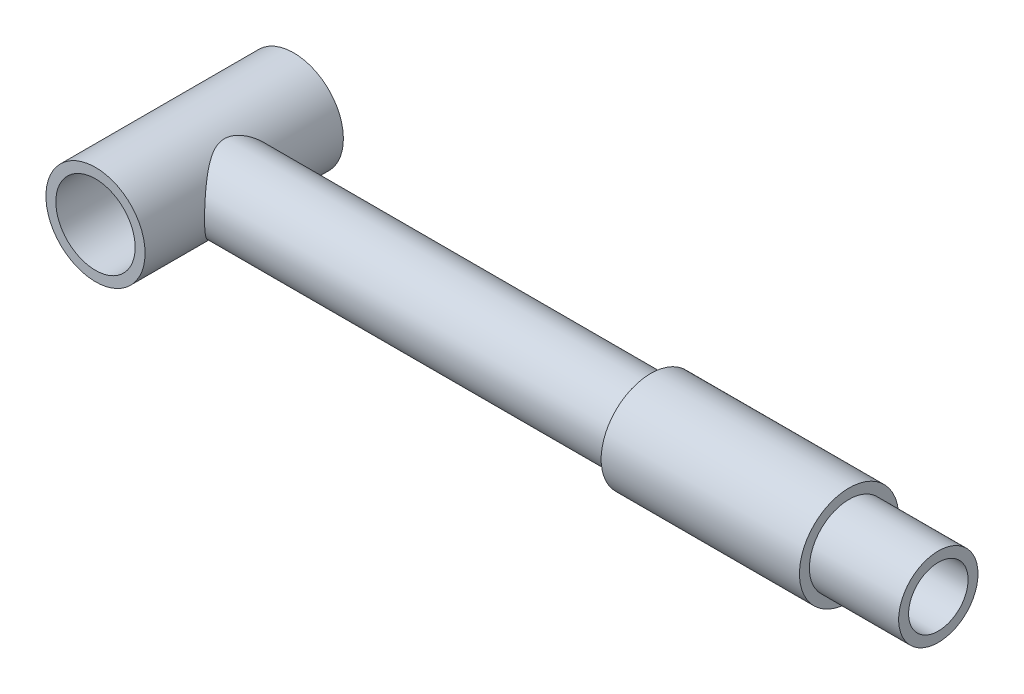
ISO-10303-21;
HEADER;
FILE_DESCRIPTION(('STEP AP214'),'2;1');
FILE_NAME('part.step','',(''),(''),'','','');
FILE_SCHEMA(('AUTOMOTIVE_DESIGN { 1 0 10303 214 1 1 1 1 }'));
ENDSEC;
DATA;
#1=APPLICATION_CONTEXT('core data for automotive mechanical design processes');
#2=APPLICATION_PROTOCOL_DEFINITION('international standard','automotive_design',2000,#1);
#3=PRODUCT_CONTEXT('',#1,'mechanical');
#4=PRODUCT('Part','Part','',(#3));
#5=PRODUCT_RELATED_PRODUCT_CATEGORY('part','',(#4));
#6=PRODUCT_DEFINITION_FORMATION('','',#4);
#7=PRODUCT_DEFINITION_CONTEXT('part definition',#1,'design');
#8=PRODUCT_DEFINITION('design','',#6,#7);
#9=PRODUCT_DEFINITION_SHAPE('','',#8);
#10=(LENGTH_UNIT() NAMED_UNIT(*) SI_UNIT(.MILLI.,.METRE.));
#11=(NAMED_UNIT(*) PLANE_ANGLE_UNIT() SI_UNIT($,.RADIAN.));
#12=(NAMED_UNIT(*) SI_UNIT($,.STERADIAN.) SOLID_ANGLE_UNIT());
#13=UNCERTAINTY_MEASURE_WITH_UNIT(LENGTH_MEASURE(1.E-05),#10,'distance_accuracy_value','');
#14=(GEOMETRIC_REPRESENTATION_CONTEXT(3) GLOBAL_UNCERTAINTY_ASSIGNED_CONTEXT((#13)) GLOBAL_UNIT_ASSIGNED_CONTEXT((#10,
#11,#12)) REPRESENTATION_CONTEXT('',''));
#15=CARTESIAN_POINT('',(0.,0.,0.));
#16=DIRECTION('',(0.,0.,1.));
#17=DIRECTION('',(1.,0.,0.));
#18=AXIS2_PLACEMENT_3D('',#15,#16,#17);
#19=CARTESIAN_POINT('',(37.5,0.,0.));
#20=DIRECTION('',(-1.,0.,0.));
#21=DIRECTION('',(0.,0.,1.));
#22=AXIS2_PLACEMENT_3D('',#19,#20,#21);
#23=CYLINDRICAL_SURFACE('',#22,2.);
#24=CARTESIAN_POINT('',(2.5,0.,2.));
#25=CARTESIAN_POINT('',(2.49999264947401,-0.0959968964388692,1.99999242056707));
#26=CARTESIAN_POINT('',(2.49441368411908,-0.192133192964674,1.99303057133644));
#27=CARTESIAN_POINT('',(2.47259269360604,-0.381319365477407,1.96565005995827));
#28=CARTESIAN_POINT('',(2.45632708000382,-0.474361934321336,1.94520162873807));
#29=CARTESIAN_POINT('',(2.4146672181517,-0.654094916824507,1.89232172110493));
#30=CARTESIAN_POINT('',(2.38933120144167,-0.740821698128048,1.85996664856862));
#31=CARTESIAN_POINT('',(2.33136010996601,-0.906926323692543,1.78488265652265));
#32=CARTESIAN_POINT('',(2.29872501207752,-0.986304144671504,1.74215370414941));
#33=CARTESIAN_POINT('',(2.21575664728952,-1.16318123656703,1.63137163496894));
#34=CARTESIAN_POINT('',(2.16321748603216,-1.25736767952115,1.55968108482594));
#35=CARTESIAN_POINT('',(2.05292192603027,-1.43041367827883,1.4027219342605));
#36=CARTESIAN_POINT('',(1.99515072200505,-1.50922761533153,1.31741424649663));
#37=CARTESIAN_POINT('',(1.87856001629835,-1.6521591895554,1.13322601592733));
#38=CARTESIAN_POINT('',(1.81973830902028,-1.71602638457222,1.03415322702388));
#39=CARTESIAN_POINT('',(1.7088210988299,-1.82646834413604,0.823461217495809));
#40=CARTESIAN_POINT('',(1.65670347089169,-1.87310099386401,0.711885666112006));
#41=CARTESIAN_POINT('',(1.58835652300928,-1.93086043771819,0.526121048323017));
#42=CARTESIAN_POINT('',(1.56628727770188,-1.94865475820658,0.456188262019707));
#43=CARTESIAN_POINT('',(1.53069889155832,-1.97673396798331,0.312787315879533));
#44=CARTESIAN_POINT('',(1.5171587417974,-1.98703731881776,0.239328326475005));
#45=CARTESIAN_POINT('',(1.50084234061103,-1.99939840142554,0.0898074811289626));
#46=CARTESIAN_POINT('',(1.49816096926556,-2.00138345613423,0.0137285151792058));
#47=CARTESIAN_POINT('',(1.50439962302809,-1.99669481699685,-0.137704892032744));
#48=CARTESIAN_POINT('',(1.51332946660241,-1.99001379511087,-0.213058665766297));
#49=CARTESIAN_POINT('',(1.5432072129997,-1.9669530271194,-0.372222302612729));
#50=CARTESIAN_POINT('',(1.56581842049528,-1.94921808205621,-0.455508006054001));
#51=CARTESIAN_POINT('',(1.61997459936279,-1.90444547348848,-0.616535559537033));
#52=CARTESIAN_POINT('',(1.65154598198641,-1.87738025642251,-0.69426015653982));
#53=CARTESIAN_POINT('',(1.73656116159416,-1.79974102194077,-0.880662106040975));
#54=CARTESIAN_POINT('',(1.79313372968153,-1.74414886595504,-0.985802698304185));
#55=CARTESIAN_POINT('',(1.90913780060687,-1.61638467497537,-1.18371667779933));
#56=CARTESIAN_POINT('',(1.96857337048937,-1.54418846902464,-1.27647172084354));
#57=CARTESIAN_POINT('',(2.08612751968448,-1.38145818326396,-1.45127477140507));
#58=CARTESIAN_POINT('',(2.14416889260779,-1.29048701026967,-1.53297192230577));
#59=CARTESIAN_POINT('',(2.25171871494994,-1.09198491072667,-1.68009949943431));
#60=CARTESIAN_POINT('',(2.3012499182245,-0.984499645201079,-1.74557351611723));
#61=CARTESIAN_POINT('',(2.37424585643318,-0.78777781438056,-1.84056284740989));
#62=CARTESIAN_POINT('',(2.40111071224171,-0.702177727329207,-1.87500450443907));
#63=CARTESIAN_POINT('',(2.44597564111417,-0.524913923737154,-1.93212645098797));
#64=CARTESIAN_POINT('',(2.46398239496913,-0.433254836272285,-1.95481560494548));
#65=CARTESIAN_POINT('',(2.48970335685206,-0.245713233844928,-1.98713854693579));
#66=CARTESIAN_POINT('',(2.49736378633666,-0.149811307212617,-1.99670412474496));
#67=CARTESIAN_POINT('',(2.50148682701864,0.0426080028675172,-2.00185904897629));
#68=CARTESIAN_POINT('',(2.49795152409062,0.139125268327962,-1.99745099882206));
#69=CARTESIAN_POINT('',(2.48076858642945,0.321746674155462,-1.97591718375232));
#70=CARTESIAN_POINT('',(2.46796352405063,0.408060891756565,-1.95985082486099));
#71=CARTESIAN_POINT('',(2.43417513213473,0.57633567422872,-1.91712781889844));
#72=CARTESIAN_POINT('',(2.41318937553438,0.65829493885694,-1.89046802890338));
#73=CARTESIAN_POINT('',(2.36289849431328,0.821235877548908,-1.82584962821607));
#74=CARTESIAN_POINT('',(2.33315912736867,0.901843619419053,-1.78729421404364));
#75=CARTESIAN_POINT('',(2.2678362272214,1.05541000448331,-1.70113784836721));
#76=CARTESIAN_POINT('',(2.23225240258423,1.12836826593788,-1.65353644576545));
#77=CARTESIAN_POINT('',(2.14993687522397,1.27925237569143,-1.54077568170313));
#78=CARTESIAN_POINT('',(2.1023696976822,1.35550718978129,-1.47399830951701));
#79=CARTESIAN_POINT('',(2.0044349795202,1.4965368759753,-1.33061303862902));
#80=CARTESIAN_POINT('',(1.95405970991097,1.56127777727367,-1.25397716316117));
#81=CARTESIAN_POINT('',(1.87374135317135,1.65568487930787,-1.12356555676341));
#82=CARTESIAN_POINT('',(1.84354743685463,1.68913741792652,-1.07263940924667));
#83=CARTESIAN_POINT('',(1.78435415521131,1.75155001920543,-0.967377738576408));
#84=CARTESIAN_POINT('',(1.75535542951891,1.78050769868976,-0.913040428119208));
#85=CARTESIAN_POINT('',(1.69983828792997,1.83358089959817,-0.801125159718341));
#86=CARTESIAN_POINT('',(1.67331090774834,1.85771431687654,-0.743560232756315));
#87=CARTESIAN_POINT('',(1.62410209867689,1.90088481958635,-0.624991021496017));
#88=CARTESIAN_POINT('',(1.60141789380427,1.9199255893155,-0.563989262480463));
#89=CARTESIAN_POINT('',(1.5601942022258,1.95360165889083,-0.433913275762203));
#90=CARTESIAN_POINT('',(1.54209716714775,1.96779559724999,-0.364577335059652));
#91=CARTESIAN_POINT('',(1.5149337159379,1.98878905619367,-0.223162387261949));
#92=CARTESIAN_POINT('',(1.50584452307524,1.99560723074758,-0.151090779549517));
#93=CARTESIAN_POINT('',(1.49824736779721,2.00132058716546,-0.00565129453592437));
#94=CARTESIAN_POINT('',(1.49979625918437,2.00017319779789,0.0677214541541571));
#95=CARTESIAN_POINT('',(1.51330771695992,1.98996519544204,0.212984193023101));
#96=CARTESIAN_POINT('',(1.52528679347387,1.98089203653787,0.2848716473261));
#97=CARTESIAN_POINT('',(1.56207076756083,1.95207745752715,0.444606774344554));
#98=CARTESIAN_POINT('',(1.5894925841937,1.93009230408642,0.53142308249112));
#99=CARTESIAN_POINT('',(1.65288907642407,1.87608177217432,0.698633478689635));
#100=CARTESIAN_POINT('',(1.68888887211293,1.84402681542564,0.779007760036714));
#101=CARTESIAN_POINT('',(1.75491158724438,1.78094746311468,0.912177722046151));
#102=CARTESIAN_POINT('',(1.78388907325007,1.7520236319041,0.966519181518288));
#103=CARTESIAN_POINT('',(1.84307948739002,1.68964733782463,1.07183822981726));
#104=CARTESIAN_POINT('',(1.87329286211508,1.65619322765903,1.12281458495115));
#105=CARTESIAN_POINT('',(1.96437997758119,1.54918435570711,1.27077940329882));
#106=CARTESIAN_POINT('',(2.02569808481402,1.4689854164051,1.36279868666247));
#107=CARTESIAN_POINT('',(2.14418278787112,1.29001718858431,1.53338946483076));
#108=CARTESIAN_POINT('',(2.201284919641,1.19101966157649,1.61177022423678));
#109=CARTESIAN_POINT('',(2.27874650804527,1.02998399899547,1.71557672941679));
#110=CARTESIAN_POINT('',(2.30318868109328,0.9742554001997,1.74786844413512));
#111=CARTESIAN_POINT('',(2.34866115465602,0.858854828628049,1.80736810096138));
#112=CARTESIAN_POINT('',(2.36969354228912,0.799185299805367,1.83457915448451));
#113=CARTESIAN_POINT('',(2.41420905511499,0.65503773942425,1.89178005989561));
#114=CARTESIAN_POINT('',(2.43602892887628,0.569110239590122,1.91948267180093));
#115=CARTESIAN_POINT('',(2.47058864976841,0.392713097427724,1.9631576733877));
#116=CARTESIAN_POINT('',(2.48335227816872,0.30225602410314,1.9791607887746));
#117=CARTESIAN_POINT('',(2.49405378309104,0.175880930919914,1.9925630255603));
#118=CARTESIAN_POINT('',(2.49627918763429,0.140808552821274,1.99534737874577));
#119=CARTESIAN_POINT('',(2.499253810179,0.0704970748918289,1.99906746352746));
#120=CARTESIAN_POINT('',(2.50000269971647,0.0352579397117346,2.00000278378988));
#121=CARTESIAN_POINT('',(2.5,0.,2.));
#122=B_SPLINE_CURVE_WITH_KNOTS('',3,(#24,#25,#26,#27,#28,#29,#30,#31,#32,#33,#34,#35,#36,#37,
#38,#39,#40,#41,#42,#43,#44,#45,#46,#47,#48,#49,#50,#51,#52,#53,#54,#55,#56,#57,#58,#59,#60,#61,
#62,#63,#64,#65,#66,#67,#68,#69,#70,#71,#72,#73,#74,#75,#76,#77,#78,#79,#80,#81,#82,#83,#84,#85,
#86,#87,#88,#89,#90,#91,#92,#93,#94,#95,#96,#97,#98,#99,#100,#101,#102,#103,#104,#105,#106,#107,
#108,#109,#110,#111,#112,#113,#114,#115,#116,#117,#118,#119,#120,#121),.UNSPECIFIED.,.T.,.F.,(4,
2,2,2,2,2,2,2,2,2,2,2,2,2,2,2,2,2,2,2,2,2,2,2,2,2,2,2,2,2,2,2,2,2,2,2,2,2,2,2,2,2,2,2,2,2,2,2,
4),(0.,0.287836605992209,0.576310692639342,0.862965057250604,1.14962032997081,1.53607888200101,
1.92366738187851,2.31734741765481,2.70969292925127,2.9353448634113,3.1604387740811,
3.38749528500759,3.61474392028823,3.8775863003201,4.14121163495705,4.534257481883,
4.92787915886674,5.33198173288419,5.73498644040676,6.02213978124802,6.30907621738868,
6.59749843639964,6.88586692268771,7.15087004938159,7.41595185759572,7.69742753051566,
7.97891724351349,8.31365537249325,8.64936529970902,8.85316560745906,9.0570736038085,
9.26021055202078,9.46320013996581,9.68152133432596,9.89928907450684,10.1182215471168,
10.3375012031536,10.616933053181,10.8971934831173,11.1010640012511,11.3050088506911,
11.7129165318148,12.1261363563906,12.3324811048119,12.5386990694968,12.8161540735934,
13.0928777702216,13.1985714874516,13.3042887145431),.UNSPECIFIED.);
#123=CARTESIAN_POINT('',(2.5,0.,2.));
#124=VERTEX_POINT('',#123);
#125=EDGE_CURVE('E50',#124,#124,#122,.T.);
#126=ORIENTED_EDGE('',*,*,#125,.T.);
#127=EDGE_LOOP('',(#126));
#128=FACE_BOUND('',#127,.T.);
#129=CARTESIAN_POINT('',(22.9977370415362,0.,0.));
#130=DIRECTION('',(1.,0.,0.));
#131=DIRECTION('',(0.,0.,-1.));
#132=AXIS2_PLACEMENT_3D('',#129,#130,#131);
#133=CIRCLE('',#132,2.);
#134=CARTESIAN_POINT('',(22.9977370415362,0.,-2.));
#135=VERTEX_POINT('',#134);
#136=EDGE_CURVE('E10',#135,#135,#133,.T.);
#137=ORIENTED_EDGE('',*,*,#136,.F.);
#138=EDGE_LOOP('',(#137));
#139=FACE_BOUND('',#138,.T.);
#140=ADVANCED_FACE('F41',(#128,#139),#23,.T.);
#141=CARTESIAN_POINT('',(0.,0.,5.));
#142=DIRECTION('',(0.,0.,-1.));
#143=DIRECTION('',(-1.,0.,0.));
#144=AXIS2_PLACEMENT_3D('',#141,#142,#143);
#145=CYLINDRICAL_SURFACE('',#144,2.5);
#146=CARTESIAN_POINT('',(0.,0.,-5.));
#147=DIRECTION('',(0.,0.,1.));
#148=DIRECTION('',(1.,0.,0.));
#149=AXIS2_PLACEMENT_3D('',#146,#147,#148);
#150=CIRCLE('',#149,2.5);
#151=CARTESIAN_POINT('',(2.5,0.,-5.));
#152=VERTEX_POINT('',#151);
#153=EDGE_CURVE('E60',#152,#152,#150,.T.);
#154=ORIENTED_EDGE('',*,*,#153,.T.);
#155=EDGE_LOOP('',(#154));
#156=FACE_BOUND('',#155,.T.);
#157=CARTESIAN_POINT('',(0.,0.,5.));
#158=DIRECTION('',(0.,0.,1.));
#159=DIRECTION('',(1.,0.,0.));
#160=AXIS2_PLACEMENT_3D('',#157,#158,#159);
#161=CIRCLE('',#160,2.5);
#162=CARTESIAN_POINT('',(2.5,0.,5.));
#163=VERTEX_POINT('',#162);
#164=EDGE_CURVE('E55',#163,#163,#161,.T.);
#165=ORIENTED_EDGE('',*,*,#164,.F.);
#166=EDGE_LOOP('',(#165));
#167=FACE_BOUND('',#166,.T.);
#168=ORIENTED_EDGE('',*,*,#125,.F.);
#169=EDGE_LOOP('',(#168));
#170=FACE_BOUND('',#169,.T.);
#171=ADVANCED_FACE('F83',(#156,#167,#170),#145,.T.);
#172=CARTESIAN_POINT('',(0.,0.,5.));
#173=DIRECTION('',(0.,0.,1.));
#174=DIRECTION('',(1.,0.,0.));
#175=AXIS2_PLACEMENT_3D('',#172,#173,#174);
#176=PLANE('',#175);
#177=ORIENTED_EDGE('',*,*,#164,.T.);
#178=EDGE_LOOP('',(#177));
#179=FACE_BOUND('',#178,.T.);
#180=CARTESIAN_POINT('',(0.,0.,5.));
#181=DIRECTION('',(0.,0.,1.));
#182=DIRECTION('',(1.,0.,0.));
#183=AXIS2_PLACEMENT_3D('',#180,#181,#182);
#184=CIRCLE('',#183,2.);
#185=CARTESIAN_POINT('',(2.,0.,5.));
#186=VERTEX_POINT('',#185);
#187=EDGE_CURVE('E165',#186,#186,#184,.T.);
#188=ORIENTED_EDGE('',*,*,#187,.F.);
#189=EDGE_LOOP('',(#188));
#190=FACE_BOUND('',#189,.T.);
#191=ADVANCED_FACE('F81',(#179,#190),#176,.T.);
#192=CARTESIAN_POINT('',(0.,0.,-5.));
#193=DIRECTION('',(0.,0.,1.));
#194=DIRECTION('',(1.,0.,0.));
#195=AXIS2_PLACEMENT_3D('',#192,#193,#194);
#196=PLANE('',#195);
#197=ORIENTED_EDGE('',*,*,#153,.F.);
#198=EDGE_LOOP('',(#197));
#199=FACE_BOUND('',#198,.T.);
#200=CARTESIAN_POINT('',(0.,0.,-5.));
#201=DIRECTION('',(0.,0.,1.));
#202=DIRECTION('',(1.,0.,0.));
#203=AXIS2_PLACEMENT_3D('',#200,#201,#202);
#204=CIRCLE('',#203,2.);
#205=CARTESIAN_POINT('',(2.,0.,-5.));
#206=VERTEX_POINT('',#205);
#207=EDGE_CURVE('E162',#206,#206,#204,.T.);
#208=ORIENTED_EDGE('',*,*,#207,.T.);
#209=EDGE_LOOP('',(#208));
#210=FACE_BOUND('',#209,.T.);
#211=ADVANCED_FACE('F79',(#199,#210),#196,.F.);
#212=CARTESIAN_POINT('',(0.,0.,5.));
#213=DIRECTION('',(0.,0.,-1.));
#214=DIRECTION('',(-1.,0.,0.));
#215=AXIS2_PLACEMENT_3D('',#212,#213,#214);
#216=CYLINDRICAL_SURFACE('',#215,2.);
#217=ORIENTED_EDGE('',*,*,#187,.T.);
#218=EDGE_LOOP('',(#217));
#219=FACE_BOUND('',#218,.T.);
#220=ORIENTED_EDGE('',*,*,#207,.F.);
#221=EDGE_LOOP('',(#220));
#222=FACE_BOUND('',#221,.T.);
#223=ADVANCED_FACE('F75',(#219,#222),#216,.F.);
#224=CARTESIAN_POINT('',(22.9977370415362,0.,0.));
#225=DIRECTION('',(1.,0.,0.));
#226=DIRECTION('',(0.,0.,-1.));
#227=AXIS2_PLACEMENT_3D('',#224,#225,#226);
#228=CYLINDRICAL_SURFACE('',#227,2.5);
#229=CARTESIAN_POINT('',(22.9977370415362,0.,0.));
#230=DIRECTION('',(1.,0.,0.));
#231=DIRECTION('',(0.,0.,-1.));
#232=AXIS2_PLACEMENT_3D('',#229,#230,#231);
#233=CIRCLE('',#232,2.5);
#234=CARTESIAN_POINT('',(22.9977370415362,0.,-2.5));
#235=VERTEX_POINT('',#234);
#236=EDGE_CURVE('E119',#235,#235,#233,.T.);
#237=ORIENTED_EDGE('',*,*,#236,.T.);
#238=EDGE_LOOP('',(#237));
#239=FACE_BOUND('',#238,.T.);
#240=CARTESIAN_POINT('',(32.9977370415362,0.,0.));
#241=DIRECTION('',(1.,0.,0.));
#242=DIRECTION('',(0.,0.,-1.));
#243=AXIS2_PLACEMENT_3D('',#240,#241,#242);
#244=CIRCLE('',#243,2.5);
#245=CARTESIAN_POINT('',(32.9977370415362,0.,-2.5));
#246=VERTEX_POINT('',#245);
#247=EDGE_CURVE('E127',#246,#246,#244,.T.);
#248=ORIENTED_EDGE('',*,*,#247,.F.);
#249=EDGE_LOOP('',(#248));
#250=FACE_BOUND('',#249,.T.);
#251=ADVANCED_FACE('F78',(#239,#250),#228,.T.);
#252=CARTESIAN_POINT('',(22.9977370415362,0.,0.));
#253=DIRECTION('',(1.,0.,0.));
#254=DIRECTION('',(0.,0.,-1.));
#255=AXIS2_PLACEMENT_3D('',#252,#253,#254);
#256=PLANE('',#255);
#257=ORIENTED_EDGE('',*,*,#136,.T.);
#258=EDGE_LOOP('',(#257));
#259=FACE_BOUND('',#258,.T.);
#260=ORIENTED_EDGE('',*,*,#236,.F.);
#261=EDGE_LOOP('',(#260));
#262=FACE_BOUND('',#261,.T.);
#263=ADVANCED_FACE('F110',(#259,#262),#256,.F.);
#264=CARTESIAN_POINT('',(32.9977370415362,0.,0.));
#265=DIRECTION('',(1.,0.,0.));
#266=DIRECTION('',(0.,0.,-1.));
#267=AXIS2_PLACEMENT_3D('',#264,#265,#266);
#268=PLANE('',#267);
#269=CARTESIAN_POINT('',(32.9977370415362,0.,0.));
#270=DIRECTION('',(1.,0.,0.));
#271=DIRECTION('',(0.,0.,-1.));
#272=AXIS2_PLACEMENT_3D('',#269,#270,#271);
#273=CIRCLE('',#272,2.);
#274=CARTESIAN_POINT('',(32.9977370415362,0.,-2.));
#275=VERTEX_POINT('',#274);
#276=EDGE_CURVE('E152',#275,#275,#273,.T.);
#277=ORIENTED_EDGE('',*,*,#276,.F.);
#278=EDGE_LOOP('',(#277));
#279=FACE_BOUND('',#278,.T.);
#280=ORIENTED_EDGE('',*,*,#247,.T.);
#281=EDGE_LOOP('',(#280));
#282=FACE_BOUND('',#281,.T.);
#283=ADVANCED_FACE('F103',(#279,#282),#268,.T.);
#284=CARTESIAN_POINT('',(2.5,0.,-1.5));
#285=CARTESIAN_POINT('',(2.49999625789732,0.0767298334620158,-1.49999590899012));
#286=CARTESIAN_POINT('',(2.4964290461501,0.153582320644178,-1.49407132907374));
#287=CARTESIAN_POINT('',(2.48249903608568,0.304975509530679,-1.47067568048467));
#288=CARTESIAN_POINT('',(2.47211948032719,0.379510034596047,-1.45317613814578));
#289=CARTESIAN_POINT('',(2.44561558054488,0.523751827790837,-1.40761363883314));
#290=CARTESIAN_POINT('',(2.42951973272944,0.593481028226566,-1.37960304183684));
#291=CARTESIAN_POINT('',(2.39295367626407,0.727030318214658,-1.31413966685897));
#292=CARTESIAN_POINT('',(2.37248455380255,0.790851869416383,-1.27668923303125));
#293=CARTESIAN_POINT('',(2.32705360719088,0.916299278999315,-1.19022517329142));
#294=CARTESIAN_POINT('',(2.30186792195985,0.977384020081415,-1.14054630464861));
#295=CARTESIAN_POINT('',(2.25030439279634,1.09088270411891,-1.03253279617173));
#296=CARTESIAN_POINT('',(2.22392505153571,1.14328534948112,-0.974187062812683));
#297=CARTESIAN_POINT('',(2.1691106699591,1.24444996762974,-0.842076489503268));
#298=CARTESIAN_POINT('',(2.14082017703649,1.29197766378809,-0.767298229018711));
#299=CARTESIAN_POINT('',(2.08938301412124,1.37361437764896,-0.609153426756886));
#300=CARTESIAN_POINT('',(2.06622802273938,1.4077451733516,-0.525801103752432));
#301=CARTESIAN_POINT('',(2.0335462966093,1.45440601714221,-0.373403549346759));
#302=CARTESIAN_POINT('',(2.02207883137591,1.47016197246826,-0.305764001389683));
#303=CARTESIAN_POINT('',(2.00590308295503,1.49216172340475,-0.168196284169636));
#304=CARTESIAN_POINT('',(2.00118639643759,1.49841734556836,-0.098271071245506));
#305=CARTESIAN_POINT('',(1.99920922463856,1.50105508796009,0.0420114942173356));
#306=CARTESIAN_POINT('',(2.00196337012718,1.49741783408419,0.112369425093197));
#307=CARTESIAN_POINT('',(2.01453261443741,1.48046060478828,0.251278775427587));
#308=CARTESIAN_POINT('',(2.02435302432226,1.46713334620103,0.319828795847444));
#309=CARTESIAN_POINT('',(2.04953186944258,1.43173921881792,0.452530242128106));
#310=CARTESIAN_POINT('',(2.06481711652537,1.40978748666087,0.516727053924483));
#311=CARTESIAN_POINT('',(2.09927051350828,1.35795061770837,0.640694990928123));
#312=CARTESIAN_POINT('',(2.11844008623465,1.32806257259705,0.700464483423926));
#313=CARTESIAN_POINT('',(2.16255327268985,1.25517983184583,0.824984097122803));
#314=CARTESIAN_POINT('',(2.18792043372992,1.21080724397723,0.888778092954927));
#315=CARTESIAN_POINT('',(2.23930599764381,1.11291092784003,1.00867648366702));
#316=CARTESIAN_POINT('',(2.26532500262149,1.05937845100579,1.06477343397651));
#317=CARTESIAN_POINT('',(2.31935504958317,0.935811834382965,1.17561298182176));
#318=CARTESIAN_POINT('',(2.34713836268532,0.864517682704956,1.22907730601599));
#319=CARTESIAN_POINT('',(2.39772428433981,0.712276050458999,1.32312204719791));
#320=CARTESIAN_POINT('',(2.42052955425515,0.631333763943563,1.36370935378995));
#321=CARTESIAN_POINT('',(2.45730392066151,0.467197585268205,1.4279321827959));
#322=CARTESIAN_POINT('',(2.47173957439704,0.384467624173579,1.45247535571591));
#323=CARTESIAN_POINT('',(2.49218842813551,0.215047895144639,1.48701119740538));
#324=CARTESIAN_POINT('',(2.49821172952738,0.128363005661318,1.49702131775358));
#325=CARTESIAN_POINT('',(2.5009057037461,-0.0337146143773971,1.50150784767831));
#326=CARTESIAN_POINT('',(2.49873521714286,-0.109042473418719,1.49790885508517));
#327=CARTESIAN_POINT('',(2.48778712087048,-0.257829401986061,1.47957414692808));
#328=CARTESIAN_POINT('',(2.47900964518037,-0.331288509376106,1.46483865719419));
#329=CARTESIAN_POINT('',(2.4559479244219,-0.472574932157613,1.42545656718754));
#330=CARTESIAN_POINT('',(2.44180275662555,-0.540495750928484,1.40105965092653));
#331=CARTESIAN_POINT('',(2.40913880862844,-0.671265749087263,1.34332262363473));
#332=CARTESIAN_POINT('',(2.39061916586511,-0.734113924963909,1.30998074865333));
#333=CARTESIAN_POINT('',(2.3484549623736,-0.860006262823864,1.23144302079129));
#334=CARTESIAN_POINT('',(2.3244780273988,-0.922394150456838,1.18537617092161));
#335=CARTESIAN_POINT('',(2.27474265574731,-1.03902603131014,1.08460860651138));
#336=CARTESIAN_POINT('',(2.2489821658636,-1.09326040273738,1.02989784514746));
#337=CARTESIAN_POINT('',(2.19445423909891,-1.19931996735579,0.905089609962848));
#338=CARTESIAN_POINT('',(2.16573241746291,-1.24991019630915,0.833916114534496));
#339=CARTESIAN_POINT('',(2.1121618206671,-1.33845238915668,0.682783975431796));
#340=CARTESIAN_POINT('',(2.0873089799769,-1.37641766769781,0.602834706107215));
#341=CARTESIAN_POINT('',(2.04984909240519,-1.43142578795776,0.453756977693311));
#342=CARTESIAN_POINT('',(2.03575659328729,-1.4512162533619,0.386019687641411));
#343=CARTESIAN_POINT('',(2.01409605743544,-1.48113663905972,0.247467921919896));
#344=CARTESIAN_POINT('',(2.00651897642721,-1.49127995297631,0.176657855672172));
#345=CARTESIAN_POINT('',(1.99900446616268,-1.50134130416631,0.0336230524029674));
#346=CARTESIAN_POINT('',(1.99909576445937,-1.50122089107869,-0.0386059906870437));
#347=CARTESIAN_POINT('',(2.0069771789285,-1.49066472959328,-0.18189443560946));
#348=CARTESIAN_POINT('',(2.0147714813882,-1.48022337215759,-0.252953180080597));
#349=CARTESIAN_POINT('',(2.0363318524298,-1.45040174148913,-0.388488417572187));
#350=CARTESIAN_POINT('',(2.04979211805581,-1.43147636845351,-0.453117094306871));
#351=CARTESIAN_POINT('',(2.08105501960151,-1.38563242076993,-0.578337254474216));
#352=CARTESIAN_POINT('',(2.09885929040482,-1.35871083588479,-0.638927206960553));
#353=CARTESIAN_POINT('',(2.14012990550917,-1.29289245555732,-0.76431985722078));
#354=CARTESIAN_POINT('',(2.16404587582639,-1.25279167675753,-0.828341103854308));
#355=CARTESIAN_POINT('',(2.21320127030768,-1.16375698389084,-0.94938007261729));
#356=CARTESIAN_POINT('',(2.23844177205021,-1.11481579607798,-1.00639196215256));
#357=CARTESIAN_POINT('',(2.29225690291476,-1.00009777425734,-1.12135094913167));
#358=CARTESIAN_POINT('',(2.32070308663658,-0.932876819313905,-1.17793107489619));
#359=CARTESIAN_POINT('',(2.37365428872367,-0.788462434445589,-1.27909785586331));
#360=CARTESIAN_POINT('',(2.39815789310936,-0.71126544450154,-1.32368021198479));
#361=CARTESIAN_POINT('',(2.43985578654394,-0.551125230801454,-1.39778580757374));
#362=CARTESIAN_POINT('',(2.45725077479787,-0.468430086957214,-1.42772806492683));
#363=CARTESIAN_POINT('',(2.48366273001246,-0.297973306118808,-1.47272469521098));
#364=CARTESIAN_POINT('',(2.49271125871485,-0.210232099648613,-1.48783516785699));
#365=CARTESIAN_POINT('',(2.49802001168187,-0.101558096917536,-1.49669745470866));
#366=CARTESIAN_POINT('',(2.49876114656362,-0.0812762590282776,-1.4979344173061));
#367=CARTESIAN_POINT('',(2.49975164517367,-0.0406658206871124,-1.49958624637086));
#368=CARTESIAN_POINT('',(2.50000099184316,-0.0203372186375695,-1.5000010843209));
#369=CARTESIAN_POINT('',(2.5,0.,-1.5));
#370=B_SPLINE_CURVE_WITH_KNOTS('',3,(#284,#285,#286,#287,#288,#289,#290,#291,#292,#293,#294,
#295,#296,#297,#298,#299,#300,#301,#302,#303,#304,#305,#306,#307,#308,#309,#310,#311,#312,#313,
#314,#315,#316,#317,#318,#319,#320,#321,#322,#323,#324,#325,#326,#327,#328,#329,#330,#331,#332,
#333,#334,#335,#336,#337,#338,#339,#340,#341,#342,#343,#344,#345,#346,#347,#348,#349,#350,#351,
#352,#353,#354,#355,#356,#357,#358,#359,#360,#361,#362,#363,#364,#365,#366,#367,#368,#369),
.UNSPECIFIED.,.T.,.F.,(4,2,2,2,2,2,2,2,2,2,2,2,2,2,2,2,2,2,2,2,2,2,2,2,2,2,2,2,2,2,2,2,2,2,2,2,
2,2,2,2,2,2,4),(0.,0.230102237548649,0.460772627520012,0.690308884600012,0.919788197992274,
1.16681590732473,1.414162579348,1.69183813189807,1.96906040692092,2.17933829855633,
2.38935420916578,2.59978170870726,2.81036753273872,3.01823267593207,3.22617409809868,
3.47046995225163,3.71500044803674,3.99360957884691,4.27206939275324,4.53296790696559,
4.79355286918236,5.01875602722426,5.24395461863455,5.46367785689772,5.68344445659025,
5.92601365818362,6.16886690081836,6.44336762428009,6.71757792616456,6.93257787314692,
7.14727888733318,7.36278425777433,7.57840681155725,7.78364098331142,7.98895251523035,
8.22578610052286,8.46281544370208,8.73854311775519,9.01436946031985,9.28175654462677,
9.54812832184448,9.60911473335177,9.6701032602764),.UNSPECIFIED.);
#371=CARTESIAN_POINT('',(2.5,0.,-1.5));
#372=VERTEX_POINT('',#371);
#373=EDGE_CURVE('E115',#372,#372,#370,.T.);
#374=ORIENTED_EDGE('',*,*,#373,.T.);
#375=EDGE_LOOP('',(#374));
#376=FACE_BOUND('',#375,.T.);
#377=ADVANCED_FACE('F43',(#376),#145,.T.);
#378=CARTESIAN_POINT('',(37.5,0.,0.));
#379=DIRECTION('',(-1.,0.,0.));
#380=DIRECTION('',(0.,0.,1.));
#381=AXIS2_PLACEMENT_3D('',#378,#379,#380);
#382=CYLINDRICAL_SURFACE('',#381,1.5);
#383=CARTESIAN_POINT('',(37.5,0.,0.));
#384=DIRECTION('',(1.,0.,0.));
#385=DIRECTION('',(0.,0.,-1.));
#386=AXIS2_PLACEMENT_3D('',#383,#384,#385);
#387=CIRCLE('',#386,1.5);
#388=CARTESIAN_POINT('',(37.5,0.,-1.5));
#389=VERTEX_POINT('',#388);
#390=EDGE_CURVE('E118',#389,#389,#387,.T.);
#391=ORIENTED_EDGE('',*,*,#390,.T.);
#392=EDGE_LOOP('',(#391));
#393=FACE_BOUND('',#392,.T.);
#394=ORIENTED_EDGE('',*,*,#373,.F.);
#395=EDGE_LOOP('',(#394));
#396=FACE_BOUND('',#395,.T.);
#397=ADVANCED_FACE('F102',(#393,#396),#382,.F.);
#398=CARTESIAN_POINT('',(37.5,0.,0.));
#399=DIRECTION('',(1.,0.,0.));
#400=DIRECTION('',(0.,0.,-1.));
#401=AXIS2_PLACEMENT_3D('',#398,#399,#400);
#402=PLANE('',#401);
#403=CARTESIAN_POINT('',(37.5,0.,0.));
#404=DIRECTION('',(1.,0.,0.));
#405=DIRECTION('',(0.,0.,-1.));
#406=AXIS2_PLACEMENT_3D('',#403,#404,#405);
#407=CIRCLE('',#406,2.);
#408=CARTESIAN_POINT('',(37.5,0.,-2.));
#409=VERTEX_POINT('',#408);
#410=EDGE_CURVE('E124',#409,#409,#407,.T.);
#411=ORIENTED_EDGE('',*,*,#410,.T.);
#412=EDGE_LOOP('',(#411));
#413=FACE_BOUND('',#412,.T.);
#414=ORIENTED_EDGE('',*,*,#390,.F.);
#415=EDGE_LOOP('',(#414));
#416=FACE_BOUND('',#415,.T.);
#417=ADVANCED_FACE('F72',(#413,#416),#402,.T.);
#418=ORIENTED_EDGE('',*,*,#276,.T.);
#419=EDGE_LOOP('',(#418));
#420=FACE_BOUND('',#419,.T.);
#421=ORIENTED_EDGE('',*,*,#410,.F.);
#422=EDGE_LOOP('',(#421));
#423=FACE_BOUND('',#422,.T.);
#424=ADVANCED_FACE('F67',(#420,#423),#23,.T.);
#425=CLOSED_SHELL('',(#140,#171,#191,#211,#223,#251,#263,#283,#377,#397,#417,#424));
#426=MANIFOLD_SOLID_BREP('B2',#425);
#427=ADVANCED_BREP_SHAPE_REPRESENTATION('',(#18,#426),#14);
#428=SHAPE_DEFINITION_REPRESENTATION(#9,#427);
ENDSEC;
END-ISO-10303-21;
